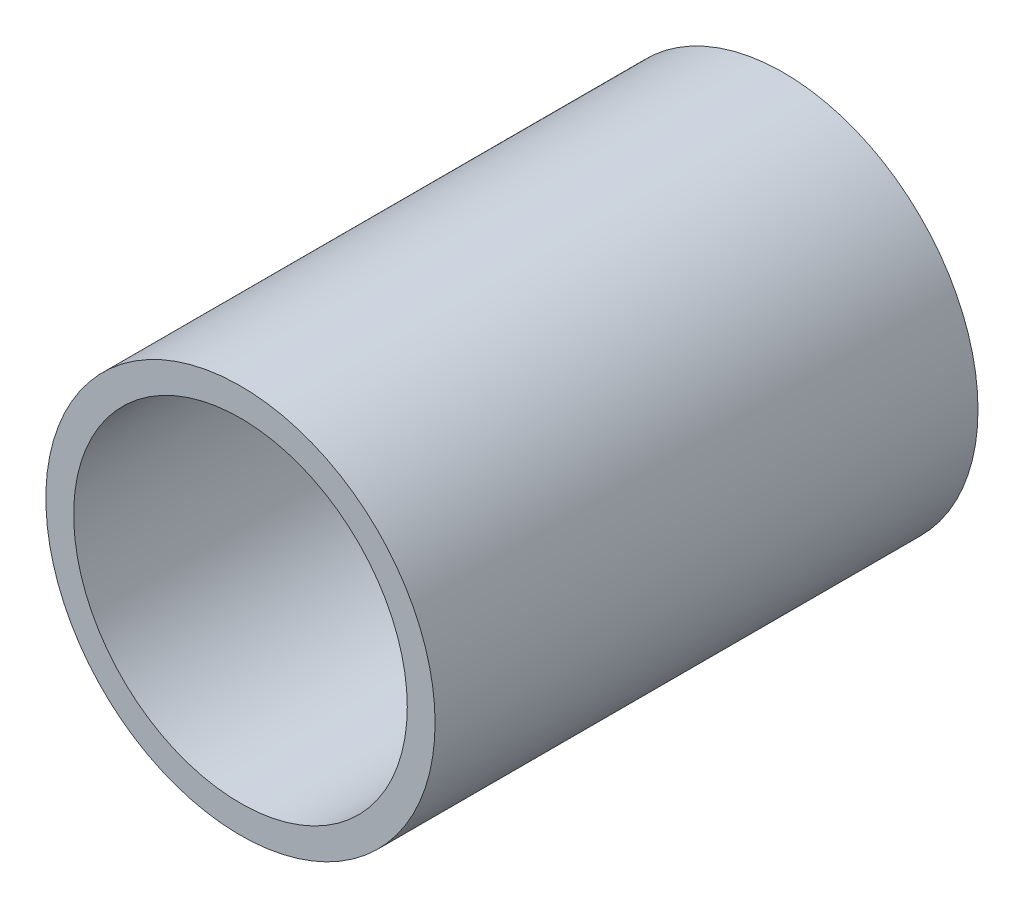
ISO-10303-21;
HEADER;
FILE_DESCRIPTION(('STEP AP214'),'2;1');
FILE_NAME('part.step','',(''),(''),'','','');
FILE_SCHEMA(('AUTOMOTIVE_DESIGN { 1 0 10303 214 1 1 1 1 }'));
ENDSEC;
DATA;
#1=APPLICATION_CONTEXT('core data for automotive mechanical design processes');
#2=APPLICATION_PROTOCOL_DEFINITION('international standard','automotive_design',2000,#1);
#3=PRODUCT_CONTEXT('',#1,'mechanical');
#4=PRODUCT('Part','Part','',(#3));
#5=PRODUCT_RELATED_PRODUCT_CATEGORY('part','',(#4));
#6=PRODUCT_DEFINITION_FORMATION('','',#4);
#7=PRODUCT_DEFINITION_CONTEXT('part definition',#1,'design');
#8=PRODUCT_DEFINITION('design','',#6,#7);
#9=PRODUCT_DEFINITION_SHAPE('','',#8);
#10=(LENGTH_UNIT() NAMED_UNIT(*) SI_UNIT(.MILLI.,.METRE.));
#11=(NAMED_UNIT(*) PLANE_ANGLE_UNIT() SI_UNIT($,.RADIAN.));
#12=(NAMED_UNIT(*) SI_UNIT($,.STERADIAN.) SOLID_ANGLE_UNIT());
#13=UNCERTAINTY_MEASURE_WITH_UNIT(LENGTH_MEASURE(1.E-05),#10,'distance_accuracy_value','');
#14=(GEOMETRIC_REPRESENTATION_CONTEXT(3) GLOBAL_UNCERTAINTY_ASSIGNED_CONTEXT((#13)) GLOBAL_UNIT_ASSIGNED_CONTEXT((#10,
#11,#12)) REPRESENTATION_CONTEXT('',''));
#15=CARTESIAN_POINT('',(0.,0.,0.));
#16=DIRECTION('',(0.,0.,1.));
#17=DIRECTION('',(1.,0.,0.));
#18=AXIS2_PLACEMENT_3D('',#15,#16,#17);
#19=CARTESIAN_POINT('',(0.,0.,62.));
#20=DIRECTION('',(0.,0.,1.));
#21=DIRECTION('',(1.,0.,0.));
#22=AXIS2_PLACEMENT_3D('',#19,#20,#21);
#23=PLANE('',#22);
#24=CARTESIAN_POINT('',(0.,0.,62.));
#25=DIRECTION('',(0.,0.,1.));
#26=DIRECTION('',(1.,0.,0.));
#27=AXIS2_PLACEMENT_3D('',#24,#25,#26);
#28=CIRCLE('',#27,44.45);
#29=CARTESIAN_POINT('',(44.45,0.,62.));
#30=VERTEX_POINT('',#29);
#31=EDGE_CURVE('E10',#30,#30,#28,.T.);
#32=ORIENTED_EDGE('',*,*,#31,.T.);
#33=EDGE_LOOP('',(#32));
#34=FACE_BOUND('',#33,.T.);
#35=CARTESIAN_POINT('',(0.,0.,62.));
#36=DIRECTION('',(0.,0.,1.));
#37=DIRECTION('',(1.,0.,0.));
#38=AXIS2_PLACEMENT_3D('',#35,#36,#37);
#39=CIRCLE('',#38,38.1);
#40=CARTESIAN_POINT('',(38.1,0.,62.));
#41=VERTEX_POINT('',#40);
#42=EDGE_CURVE('E41',#41,#41,#39,.T.);
#43=ORIENTED_EDGE('',*,*,#42,.F.);
#44=EDGE_LOOP('',(#43));
#45=FACE_BOUND('',#44,.T.);
#46=ADVANCED_FACE('F30',(#34,#45),#23,.T.);
#47=CARTESIAN_POINT('',(0.,0.,-62.));
#48=DIRECTION('',(0.,0.,1.));
#49=DIRECTION('',(1.,0.,0.));
#50=AXIS2_PLACEMENT_3D('',#47,#48,#49);
#51=PLANE('',#50);
#52=CARTESIAN_POINT('',(0.,0.,-62.));
#53=DIRECTION('',(0.,0.,1.));
#54=DIRECTION('',(1.,0.,0.));
#55=AXIS2_PLACEMENT_3D('',#52,#53,#54);
#56=CIRCLE('',#55,44.45);
#57=CARTESIAN_POINT('',(44.45,0.,-62.));
#58=VERTEX_POINT('',#57);
#59=EDGE_CURVE('E34',#58,#58,#56,.T.);
#60=ORIENTED_EDGE('',*,*,#59,.F.);
#61=EDGE_LOOP('',(#60));
#62=FACE_BOUND('',#61,.T.);
#63=CARTESIAN_POINT('',(0.,0.,-62.));
#64=DIRECTION('',(0.,0.,1.));
#65=DIRECTION('',(1.,0.,0.));
#66=AXIS2_PLACEMENT_3D('',#63,#64,#65);
#67=CIRCLE('',#66,38.1);
#68=CARTESIAN_POINT('',(38.1,0.,-62.));
#69=VERTEX_POINT('',#68);
#70=EDGE_CURVE('E43',#69,#69,#67,.T.);
#71=ORIENTED_EDGE('',*,*,#70,.T.);
#72=EDGE_LOOP('',(#71));
#73=FACE_BOUND('',#72,.T.);
#74=ADVANCED_FACE('F53',(#62,#73),#51,.F.);
#75=CARTESIAN_POINT('',(0.,0.,62.));
#76=DIRECTION('',(0.,0.,-1.));
#77=DIRECTION('',(-1.,0.,0.));
#78=AXIS2_PLACEMENT_3D('',#75,#76,#77);
#79=CYLINDRICAL_SURFACE('',#78,44.45);
#80=ORIENTED_EDGE('',*,*,#31,.F.);
#81=EDGE_LOOP('',(#80));
#82=FACE_BOUND('',#81,.T.);
#83=ORIENTED_EDGE('',*,*,#59,.T.);
#84=EDGE_LOOP('',(#83));
#85=FACE_BOUND('',#84,.T.);
#86=ADVANCED_FACE('F32',(#82,#85),#79,.T.);
#87=CARTESIAN_POINT('',(0.,0.,62.));
#88=DIRECTION('',(0.,0.,-1.));
#89=DIRECTION('',(-1.,0.,0.));
#90=AXIS2_PLACEMENT_3D('',#87,#88,#89);
#91=CYLINDRICAL_SURFACE('',#90,38.1);
#92=ORIENTED_EDGE('',*,*,#42,.T.);
#93=EDGE_LOOP('',(#92));
#94=FACE_BOUND('',#93,.T.);
#95=ORIENTED_EDGE('',*,*,#70,.F.);
#96=EDGE_LOOP('',(#95));
#97=FACE_BOUND('',#96,.T.);
#98=ADVANCED_FACE('F49',(#94,#97),#91,.F.);
#99=CLOSED_SHELL('',(#46,#74,#86,#98));
#100=MANIFOLD_SOLID_BREP('B2',#99);
#101=ADVANCED_BREP_SHAPE_REPRESENTATION('',(#18,#100),#14);
#102=SHAPE_DEFINITION_REPRESENTATION(#9,#101);
ENDSEC;
END-ISO-10303-21;
